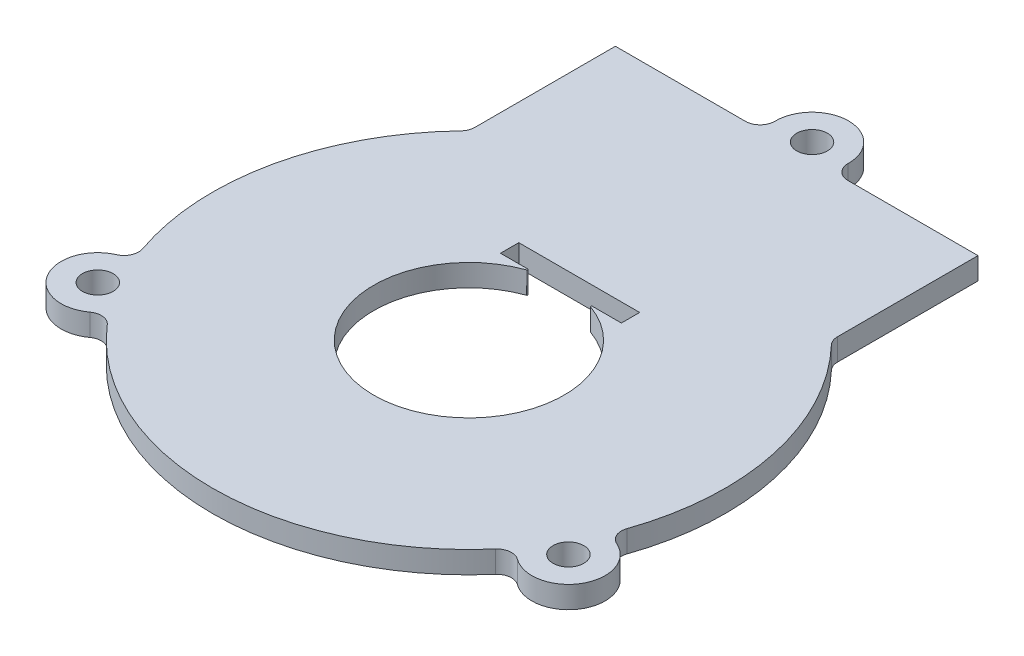
ISO-10303-21;
HEADER;
FILE_DESCRIPTION(('STEP AP214'),'2;1');
FILE_NAME('part.step','',(''),(''),'','','');
FILE_SCHEMA(('AUTOMOTIVE_DESIGN { 1 0 10303 214 1 1 1 1 }'));
ENDSEC;
DATA;
#1=APPLICATION_CONTEXT('core data for automotive mechanical design processes');
#2=APPLICATION_PROTOCOL_DEFINITION('international standard','automotive_design',2000,#1);
#3=PRODUCT_CONTEXT('',#1,'mechanical');
#4=PRODUCT('Part','Part','',(#3));
#5=PRODUCT_RELATED_PRODUCT_CATEGORY('part','',(#4));
#6=PRODUCT_DEFINITION_FORMATION('','',#4);
#7=PRODUCT_DEFINITION_CONTEXT('part definition',#1,'design');
#8=PRODUCT_DEFINITION('design','',#6,#7);
#9=PRODUCT_DEFINITION_SHAPE('','',#8);
#10=(LENGTH_UNIT() NAMED_UNIT(*) SI_UNIT(.MILLI.,.METRE.));
#11=(NAMED_UNIT(*) PLANE_ANGLE_UNIT() SI_UNIT($,.RADIAN.));
#12=(NAMED_UNIT(*) SI_UNIT($,.STERADIAN.) SOLID_ANGLE_UNIT());
#13=UNCERTAINTY_MEASURE_WITH_UNIT(LENGTH_MEASURE(1.E-05),#10,'distance_accuracy_value','');
#14=(GEOMETRIC_REPRESENTATION_CONTEXT(3) GLOBAL_UNCERTAINTY_ASSIGNED_CONTEXT((#13)) GLOBAL_UNIT_ASSIGNED_CONTEXT((#10,
#11,#12)) REPRESENTATION_CONTEXT('',''));
#15=CARTESIAN_POINT('',(0.,0.,0.));
#16=DIRECTION('',(0.,0.,1.));
#17=DIRECTION('',(1.,0.,0.));
#18=AXIS2_PLACEMENT_3D('',#15,#16,#17);
#19=CARTESIAN_POINT('',(0.,3.,0.));
#20=DIRECTION('',(0.,1.,0.));
#21=DIRECTION('',(0.,0.,1.));
#22=AXIS2_PLACEMENT_3D('',#19,#20,#21);
#23=PLANE('',#22);
#24=CARTESIAN_POINT('',(-32.1480166138315,3.,18.5087961651664));
#25=DIRECTION('',(0.,1.,0.));
#26=DIRECTION('',(0.,0.,1.));
#27=AXIS2_PLACEMENT_3D('',#24,#25,#26);
#28=CIRCLE('',#27,2.09999999999999);
#29=CARTESIAN_POINT('',(-32.1480166138315,3.,20.6087961651664));
#30=VERTEX_POINT('',#29);
#31=EDGE_CURVE('E260',#30,#30,#28,.T.);
#32=ORIENTED_EDGE('',*,*,#31,.F.);
#33=EDGE_LOOP('',(#32));
#34=FACE_BOUND('',#33,.T.);
#35=DIRECTION('',(-3.02063810260161E-06,0.,-0.999999999995438));
#36=VECTOR('',#35,1.);
#37=CARTESIAN_POINT('',(-24.7478001128037,3.,-24.7496745347634));
#38=LINE('',#37,#36);
#39=CARTESIAN_POINT('',(-24.7478025747881,3.,-25.5647289504072));
#40=VERTEX_POINT('',#39);
#41=CARTESIAN_POINT('',(-24.7478605121482,3.,-44.7452325826062));
#42=VERTEX_POINT('',#41);
#43=EDGE_CURVE('E308',#40,#42,#38,.T.);
#44=ORIENTED_EDGE('',*,*,#43,.F.);
#45=CARTESIAN_POINT('',(-26.747802574779,3.,-25.564722909131));
#46=DIRECTION('',(0.,1.,0.));
#47=DIRECTION('',(0.,0.,1.));
#48=AXIS2_PLACEMENT_3D('',#45,#46,#47);
#49=CIRCLE('',#48,2.);
#50=CARTESIAN_POINT('',(-25.3019754085747,3.,-24.1828459951239));
#51=VERTEX_POINT('',#50);
#52=EDGE_CURVE('E333',#40,#51,#49,.F.);
#53=ORIENTED_EDGE('',*,*,#52,.T.);
#54=CARTESIAN_POINT('',(0.,3.,0.));
#55=DIRECTION('',(0.,1.,0.));
#56=DIRECTION('',(0.,0.,1.));
#57=AXIS2_PLACEMENT_3D('',#54,#55,#56);
#58=CIRCLE('',#57,35.);
#59=CARTESIAN_POINT('',(-33.072840065109,3.,11.4537002766671));
#60=VERTEX_POINT('',#59);
#61=EDGE_CURVE('E319',#51,#60,#58,.T.);
#62=ORIENTED_EDGE('',*,*,#61,.T.);
#63=CARTESIAN_POINT('',(-34.9627166402581,3.,12.1081974353338));
#64=DIRECTION('',(0.,1.,0.));
#65=DIRECTION('',(0.,0.,1.));
#66=AXIS2_PLACEMENT_3D('',#63,#64,#65);
#67=CIRCLE('',#66,2.);
#68=CARTESIAN_POINT('',(-34.1580179965192,3.,13.9391698799011));
#69=VERTEX_POINT('',#68);
#70=EDGE_CURVE('E343',#60,#69,#67,.F.);
#71=ORIENTED_EDGE('',*,*,#70,.T.);
#72=CARTESIAN_POINT('',(-32.1464555555357,3.,18.5161819435163));
#73=DIRECTION('',(0.,1.,0.));
#74=DIRECTION('',(0.,0.,1.));
#75=AXIS2_PLACEMENT_3D('',#72,#73,#74);
#76=CIRCLE('',#75,4.99954226749351);
#77=CARTESIAN_POINT('',(-29.1966357044392,3.,22.5527628891349));
#78=VERTEX_POINT('',#77);
#79=EDGE_CURVE('E266',#69,#78,#76,.T.);
#80=ORIENTED_EDGE('',*,*,#79,.T.);
#81=CARTESIAN_POINT('',(-28.0165997358363,3.,24.1675430948605));
#82=DIRECTION('',(0.,1.,0.));
#83=DIRECTION('',(0.,0.,1.));
#84=AXIS2_PLACEMENT_3D('',#81,#82,#83);
#85=CIRCLE('',#84,2.);
#86=CARTESIAN_POINT('',(-26.5021889393046,3.,22.8611894140572));
#87=VERTEX_POINT('',#86);
#88=EDGE_CURVE('E354',#78,#87,#85,.F.);
#89=ORIENTED_EDGE('',*,*,#88,.T.);
#90=CARTESIAN_POINT('',(26.4887144081727,3.,22.8768006723464));
#91=VERTEX_POINT('',#90);
#92=EDGE_CURVE('E323',#87,#91,#58,.T.);
#93=ORIENTED_EDGE('',*,*,#92,.T.);
#94=CARTESIAN_POINT('',(28.0023552314968,3.,24.1840464250519));
#95=DIRECTION('',(0.,1.,0.));
#96=DIRECTION('',(0.,0.,1.));
#97=AXIS2_PLACEMENT_3D('',#94,#95,#96);
#98=CIRCLE('',#97,2.);
#99=CARTESIAN_POINT('',(29.184359284545,3.,22.5707062815676));
#100=VERTEX_POINT('',#99);
#101=EDGE_CURVE('E362',#91,#100,#98,.F.);
#102=ORIENTED_EDGE('',*,*,#101,.T.);
#103=CARTESIAN_POINT('',(32.1364886347761,3.,18.5412879583363));
#104=DIRECTION('',(0.,1.,0.));
#105=DIRECTION('',(0.,0.,1.));
#106=AXIS2_PLACEMENT_3D('',#103,#104,#105);
#107=CIRCLE('',#106,4.9951255964279);
#108=CARTESIAN_POINT('',(34.147287178261,3.,13.9687647007018));
#109=VERTEX_POINT('',#108);
#110=EDGE_CURVE('E277',#100,#109,#107,.T.);
#111=ORIENTED_EDGE('',*,*,#110,.T.);
#112=CARTESIAN_POINT('',(34.9523914763083,3.,12.1379705917791));
#113=DIRECTION('',(0.,1.,0.));
#114=DIRECTION('',(0.,0.,1.));
#115=AXIS2_PLACEMENT_3D('',#112,#113,#114);
#116=CIRCLE('',#115,2.);
#117=CARTESIAN_POINT('',(33.0630730181294,3.,11.4818640733046));
#118=VERTEX_POINT('',#117);
#119=EDGE_CURVE('E373',#109,#118,#116,.F.);
#120=ORIENTED_EDGE('',*,*,#119,.T.);
#121=CARTESIAN_POINT('',(25.3018293128609,3.,-24.1829988509046));
#122=VERTEX_POINT('',#121);
#123=EDGE_CURVE('E324',#118,#122,#58,.T.);
#124=ORIENTED_EDGE('',*,*,#123,.T.);
#125=CARTESIAN_POINT('',(26.7476481307387,3.,-25.5648844995277));
#126=DIRECTION('',(0.,1.,0.));
#127=DIRECTION('',(0.,0.,1.));
#128=AXIS2_PLACEMENT_3D('',#125,#126,#127);
#129=CIRCLE('',#128,2.);
#130=CARTESIAN_POINT('',(24.7476481307478,3.,-25.5648784582515));
#131=VERTEX_POINT('',#130);
#132=EDGE_CURVE('E380',#122,#131,#129,.F.);
#133=ORIENTED_EDGE('',*,*,#132,.T.);
#134=DIRECTION('',(-3.02063810260161E-06,0.,-0.999999999995438));
#135=VECTOR('',#134,1.);
#136=CARTESIAN_POINT('',(24.7476505927322,3.,-24.7498240426077));
#137=LINE('',#136,#135);
#138=CARTESIAN_POINT('',(24.7475901933877,3.,-44.7453820904505));
#139=VERTEX_POINT('',#138);
#140=EDGE_CURVE('E293',#131,#139,#137,.T.);
#141=ORIENTED_EDGE('',*,*,#140,.T.);
#142=DIRECTION('',(0.999999999995438,0.,-3.0206381024394E-06));
#143=VECTOR('',#142,1.);
#144=CARTESIAN_POINT('',(-24.7478605121482,3.,-44.7452325826062));
#145=LINE('',#144,#143);
#146=CARTESIAN_POINT('',(6.99533660471705,3.,-44.7453284673169));
#147=VERTEX_POINT('',#146);
#148=EDGE_CURVE('E304',#147,#139,#145,.T.);
#149=ORIENTED_EDGE('',*,*,#148,.F.);
#150=CARTESIAN_POINT('',(6.99533056344084,3.,-46.7453284673078));
#151=DIRECTION('',(0.,1.,0.));
#152=DIRECTION('',(0.,0.,1.));
#153=AXIS2_PLACEMENT_3D('',#150,#151,#152);
#154=CIRCLE('',#153,2.);
#155=CARTESIAN_POINT('',(4.99551899083441,3.,-46.7727815922561));
#156=VERTEX_POINT('',#155);
#157=EDGE_CURVE('E390',#147,#156,#154,.F.);
#158=ORIENTED_EDGE('',*,*,#157,.T.);
#159=CARTESIAN_POINT('',(0.,3.,-46.8413593567393));
#160=DIRECTION('',(0.,1.,0.));
#161=DIRECTION('',(0.,0.,1.));
#162=AXIS2_PLACEMENT_3D('',#159,#160,#161);
#163=CIRCLE('',#162,4.99598968149142);
#164=CARTESIAN_POINT('',(-4.99551857644603,3.,-46.7727514129473));
#165=VERTEX_POINT('',#164);
#166=EDGE_CURVE('E286',#156,#165,#163,.T.);
#167=ORIENTED_EDGE('',*,*,#166,.T.);
#168=CARTESIAN_POINT('',(-6.99532998316405,3.,-46.7452862065854));
#169=DIRECTION('',(0.,1.,0.));
#170=DIRECTION('',(0.,0.,1.));
#171=AXIS2_PLACEMENT_3D('',#168,#169,#170);
#172=CIRCLE('',#171,2.);
#173=CARTESIAN_POINT('',(-6.99532394188785,3.,-44.7452862065945));
#174=VERTEX_POINT('',#173);
#175=EDGE_CURVE('E401',#165,#174,#172,.F.);
#176=ORIENTED_EDGE('',*,*,#175,.T.);
#177=EDGE_CURVE('E305',#42,#174,#145,.T.);
#178=ORIENTED_EDGE('',*,*,#177,.F.);
#179=EDGE_LOOP('',(#44,#53,#62,#71,#80,#89,#93,#102,#111,#120,#124,#133,#141,#149,#158,#167,
#176,#178));
#180=FACE_BOUND('',#179,.T.);
#181=CARTESIAN_POINT('',(32.1247811991366,3.,18.5356173256723));
#182=DIRECTION('',(0.,1.,0.));
#183=DIRECTION('',(0.,0.,1.));
#184=AXIS2_PLACEMENT_3D('',#181,#182,#183);
#185=CIRCLE('',#184,2.1);
#186=CARTESIAN_POINT('',(32.1247811991366,3.,20.6356173256723));
#187=VERTEX_POINT('',#186);
#188=EDGE_CURVE('E271',#187,#187,#185,.T.);
#189=ORIENTED_EDGE('',*,*,#188,.F.);
#190=EDGE_LOOP('',(#189));
#191=FACE_BOUND('',#190,.T.);
#192=CARTESIAN_POINT('',(0.,3.,-46.8413593567393));
#193=DIRECTION('',(0.,1.,0.));
#194=DIRECTION('',(0.,0.,1.));
#195=AXIS2_PLACEMENT_3D('',#192,#193,#194);
#196=CIRCLE('',#195,2.09605202456873);
#197=CARTESIAN_POINT('',(0.,3.,-44.7453073321706));
#198=VERTEX_POINT('',#197);
#199=EDGE_CURVE('E282',#198,#198,#196,.T.);
#200=ORIENTED_EDGE('',*,*,#199,.F.);
#201=EDGE_LOOP('',(#200));
#202=FACE_BOUND('',#201,.T.);
#203=DIRECTION('',(-1.,0.,0.));
#204=VECTOR('',#203,1.);
#205=CARTESIAN_POINT('',(8.37780637247631,3.,-12.4336030901751));
#206=LINE('',#205,#204);
#207=CARTESIAN_POINT('',(8.37780637247631,3.,-12.4336030901751));
#208=VERTEX_POINT('',#207);
#209=CARTESIAN_POINT('',(4.41500111144088,3.,-12.4336030901751));
#210=VERTEX_POINT('',#209);
#211=EDGE_CURVE('E243',#208,#210,#206,.T.);
#212=ORIENTED_EDGE('',*,*,#211,.T.);
#213=CARTESIAN_POINT('',(4.41500111144088,3.,-12.3336030901751));
#214=DIRECTION('',(0.,1.,0.));
#215=DIRECTION('',(0.,0.,1.));
#216=AXIS2_PLACEMENT_3D('',#213,#214,#215);
#217=CIRCLE('',#216,0.1);
#218=CARTESIAN_POINT('',(4.38129881288027,3.,-12.2394534482653));
#219=VERTEX_POINT('',#218);
#220=EDGE_CURVE('E408',#210,#219,#217,.T.);
#221=ORIENTED_EDGE('',*,*,#220,.T.);
#222=CARTESIAN_POINT('',(0.,3.,0.));
#223=DIRECTION('',(0.,1.,0.));
#224=DIRECTION('',(0.,0.,1.));
#225=AXIS2_PLACEMENT_3D('',#222,#223,#224);
#226=CIRCLE('',#225,13.);
#227=CARTESIAN_POINT('',(-4.38129881288027,3.,-12.2394534482653));
#228=VERTEX_POINT('',#227);
#229=EDGE_CURVE('E254',#228,#219,#226,.T.);
#230=ORIENTED_EDGE('',*,*,#229,.F.);
#231=CARTESIAN_POINT('',(-4.41500111144089,3.,-12.3336030901751));
#232=DIRECTION('',(0.,1.,0.));
#233=DIRECTION('',(0.,0.,1.));
#234=AXIS2_PLACEMENT_3D('',#231,#232,#233);
#235=CIRCLE('',#234,0.1);
#236=CARTESIAN_POINT('',(-4.41500111144089,3.,-12.4336030901751));
#237=VERTEX_POINT('',#236);
#238=EDGE_CURVE('E406',#228,#237,#235,.T.);
#239=ORIENTED_EDGE('',*,*,#238,.T.);
#240=CARTESIAN_POINT('',(-8.12219362752369,3.,-12.4336030901751));
#241=VERTEX_POINT('',#240);
#242=EDGE_CURVE('E240',#237,#241,#206,.T.);
#243=ORIENTED_EDGE('',*,*,#242,.T.);
#244=DIRECTION('',(0.,0.,-1.));
#245=VECTOR('',#244,1.);
#246=CARTESIAN_POINT('',(-8.12219362752369,3.,-12.4336030901751));
#247=LINE('',#246,#245);
#248=CARTESIAN_POINT('',(-8.12219362752369,3.,-14.9336030901751));
#249=VERTEX_POINT('',#248);
#250=EDGE_CURVE('E221',#241,#249,#247,.T.);
#251=ORIENTED_EDGE('',*,*,#250,.T.);
#252=DIRECTION('',(-1.,0.,0.));
#253=VECTOR('',#252,1.);
#254=CARTESIAN_POINT('',(8.37780637247631,3.,-14.9336030901751));
#255=LINE('',#254,#253);
#256=CARTESIAN_POINT('',(8.37780637247631,3.,-14.9336030901751));
#257=VERTEX_POINT('',#256);
#258=EDGE_CURVE('E230',#257,#249,#255,.T.);
#259=ORIENTED_EDGE('',*,*,#258,.F.);
#260=DIRECTION('',(0.,0.,-1.));
#261=VECTOR('',#260,1.);
#262=CARTESIAN_POINT('',(8.37780637247631,3.,-12.4336030901751));
#263=LINE('',#262,#261);
#264=EDGE_CURVE('E227',#208,#257,#263,.T.);
#265=ORIENTED_EDGE('',*,*,#264,.F.);
#266=EDGE_LOOP('',(#212,#221,#230,#239,#243,#251,#259,#265));
#267=FACE_BOUND('',#266,.T.);
#268=ADVANCED_FACE('F43',(#34,#180,#191,#202,#267),#23,.T.);
#269=CARTESIAN_POINT('',(0.,0.,0.));
#270=DIRECTION('',(0.,1.,0.));
#271=DIRECTION('',(0.,0.,1.));
#272=AXIS2_PLACEMENT_3D('',#269,#270,#271);
#273=PLANE('',#272);
#274=CARTESIAN_POINT('',(0.,0.,0.));
#275=DIRECTION('',(0.,1.,0.));
#276=DIRECTION('',(0.,0.,1.));
#277=AXIS2_PLACEMENT_3D('',#274,#275,#276);
#278=CIRCLE('',#277,35.);
#279=CARTESIAN_POINT('',(-26.5021889393046,0.,22.8611894140572));
#280=VERTEX_POINT('',#279);
#281=CARTESIAN_POINT('',(26.4887144081727,0.,22.8768006723464));
#282=VERTEX_POINT('',#281);
#283=EDGE_CURVE('E328',#280,#282,#278,.T.);
#284=ORIENTED_EDGE('',*,*,#283,.F.);
#285=CARTESIAN_POINT('',(-28.0165997358363,0.,24.1675430948605));
#286=DIRECTION('',(0.,1.,0.));
#287=DIRECTION('',(0.,0.,1.));
#288=AXIS2_PLACEMENT_3D('',#285,#286,#287);
#289=CIRCLE('',#288,2.);
#290=CARTESIAN_POINT('',(-29.1966357044392,0.,22.5527628891349));
#291=VERTEX_POINT('',#290);
#292=EDGE_CURVE('E352',#280,#291,#289,.T.);
#293=ORIENTED_EDGE('',*,*,#292,.T.);
#294=CARTESIAN_POINT('',(-32.1464555555357,0.,18.5161819435163));
#295=DIRECTION('',(0.,1.,0.));
#296=DIRECTION('',(0.,0.,1.));
#297=AXIS2_PLACEMENT_3D('',#294,#295,#296);
#298=CIRCLE('',#297,4.99954226749351);
#299=CARTESIAN_POINT('',(-34.1580179965192,0.,13.9391698799011));
#300=VERTEX_POINT('',#299);
#301=EDGE_CURVE('E269',#291,#300,#298,.F.);
#302=ORIENTED_EDGE('',*,*,#301,.T.);
#303=CARTESIAN_POINT('',(-34.9627166402581,0.,12.1081974353338));
#304=DIRECTION('',(0.,1.,0.));
#305=DIRECTION('',(0.,0.,1.));
#306=AXIS2_PLACEMENT_3D('',#303,#304,#305);
#307=CIRCLE('',#306,2.);
#308=CARTESIAN_POINT('',(-33.072840065109,0.,11.4537002766671));
#309=VERTEX_POINT('',#308);
#310=EDGE_CURVE('E345',#300,#309,#307,.T.);
#311=ORIENTED_EDGE('',*,*,#310,.T.);
#312=CARTESIAN_POINT('',(-25.3019754085747,0.,-24.1828459951239));
#313=VERTEX_POINT('',#312);
#314=EDGE_CURVE('E325',#313,#309,#278,.T.);
#315=ORIENTED_EDGE('',*,*,#314,.F.);
#316=CARTESIAN_POINT('',(-26.747802574779,0.,-25.564722909131));
#317=DIRECTION('',(0.,1.,0.));
#318=DIRECTION('',(0.,0.,1.));
#319=AXIS2_PLACEMENT_3D('',#316,#317,#318);
#320=CIRCLE('',#319,2.);
#321=CARTESIAN_POINT('',(-24.7478025747881,0.,-25.5647289504072));
#322=VERTEX_POINT('',#321);
#323=EDGE_CURVE('E335',#313,#322,#320,.T.);
#324=ORIENTED_EDGE('',*,*,#323,.T.);
#325=DIRECTION('',(3.02063810260161E-06,0.,0.999999999995438));
#326=VECTOR('',#325,1.);
#327=CARTESIAN_POINT('',(-24.7478001128037,0.,-24.7496745347634));
#328=LINE('',#327,#326);
#329=CARTESIAN_POINT('',(-24.7478605121482,0.,-44.7452325826062));
#330=VERTEX_POINT('',#329);
#331=EDGE_CURVE('E294',#330,#322,#328,.T.);
#332=ORIENTED_EDGE('',*,*,#331,.F.);
#333=DIRECTION('',(-0.999999999995438,0.,3.0206381024394E-06));
#334=VECTOR('',#333,1.);
#335=CARTESIAN_POINT('',(-24.7478605121482,0.,-44.7452325826062));
#336=LINE('',#335,#334);
#337=CARTESIAN_POINT('',(-6.99532394188785,0.,-44.7452862065945));
#338=VERTEX_POINT('',#337);
#339=EDGE_CURVE('E314',#338,#330,#336,.T.);
#340=ORIENTED_EDGE('',*,*,#339,.F.);
#341=CARTESIAN_POINT('',(-6.99532998316405,0.,-46.7452862065854));
#342=DIRECTION('',(0.,1.,0.));
#343=DIRECTION('',(0.,0.,1.));
#344=AXIS2_PLACEMENT_3D('',#341,#342,#343);
#345=CIRCLE('',#344,2.);
#346=CARTESIAN_POINT('',(-4.99551857644603,0.,-46.7727514129473));
#347=VERTEX_POINT('',#346);
#348=EDGE_CURVE('E399',#338,#347,#345,.T.);
#349=ORIENTED_EDGE('',*,*,#348,.T.);
#350=CARTESIAN_POINT('',(0.,0.,-46.8413593567393));
#351=DIRECTION('',(0.,1.,0.));
#352=DIRECTION('',(0.,0.,1.));
#353=AXIS2_PLACEMENT_3D('',#350,#351,#352);
#354=CIRCLE('',#353,4.99598968149142);
#355=CARTESIAN_POINT('',(4.99551899083441,0.,-46.7727815922561));
#356=VERTEX_POINT('',#355);
#357=EDGE_CURVE('E283',#347,#356,#354,.F.);
#358=ORIENTED_EDGE('',*,*,#357,.T.);
#359=CARTESIAN_POINT('',(6.99533056344084,0.,-46.7453284673078));
#360=DIRECTION('',(0.,1.,0.));
#361=DIRECTION('',(0.,0.,1.));
#362=AXIS2_PLACEMENT_3D('',#359,#360,#361);
#363=CIRCLE('',#362,2.);
#364=CARTESIAN_POINT('',(6.99533660471705,0.,-44.7453284673169));
#365=VERTEX_POINT('',#364);
#366=EDGE_CURVE('E392',#356,#365,#363,.T.);
#367=ORIENTED_EDGE('',*,*,#366,.T.);
#368=CARTESIAN_POINT('',(24.7475901933877,0.,-44.7453820904505));
#369=VERTEX_POINT('',#368);
#370=EDGE_CURVE('E298',#369,#365,#336,.T.);
#371=ORIENTED_EDGE('',*,*,#370,.F.);
#372=DIRECTION('',(3.02063810260161E-06,0.,0.999999999995438));
#373=VECTOR('',#372,1.);
#374=CARTESIAN_POINT('',(24.7476505927322,0.,-24.7498240426077));
#375=LINE('',#374,#373);
#376=CARTESIAN_POINT('',(24.7476481307478,0.,-25.5648784582515));
#377=VERTEX_POINT('',#376);
#378=EDGE_CURVE('E297',#369,#377,#375,.T.);
#379=ORIENTED_EDGE('',*,*,#378,.T.);
#380=CARTESIAN_POINT('',(26.7476481307387,0.,-25.5648844995277));
#381=DIRECTION('',(0.,1.,0.));
#382=DIRECTION('',(0.,0.,1.));
#383=AXIS2_PLACEMENT_3D('',#380,#381,#382);
#384=CIRCLE('',#383,2.);
#385=CARTESIAN_POINT('',(25.3018293128609,0.,-24.1829988509046));
#386=VERTEX_POINT('',#385);
#387=EDGE_CURVE('E382',#377,#386,#384,.T.);
#388=ORIENTED_EDGE('',*,*,#387,.T.);
#389=CARTESIAN_POINT('',(33.0630730181294,0.,11.4818640733046));
#390=VERTEX_POINT('',#389);
#391=EDGE_CURVE('E301',#390,#386,#278,.T.);
#392=ORIENTED_EDGE('',*,*,#391,.F.);
#393=CARTESIAN_POINT('',(34.9523914763083,0.,12.1379705917791));
#394=DIRECTION('',(0.,1.,0.));
#395=DIRECTION('',(0.,0.,1.));
#396=AXIS2_PLACEMENT_3D('',#393,#394,#395);
#397=CIRCLE('',#396,2.);
#398=CARTESIAN_POINT('',(34.147287178261,0.,13.9687647007018));
#399=VERTEX_POINT('',#398);
#400=EDGE_CURVE('E371',#390,#399,#397,.T.);
#401=ORIENTED_EDGE('',*,*,#400,.T.);
#402=CARTESIAN_POINT('',(32.1364886347761,0.,18.5412879583363));
#403=DIRECTION('',(0.,1.,0.));
#404=DIRECTION('',(0.,0.,1.));
#405=AXIS2_PLACEMENT_3D('',#402,#403,#404);
#406=CIRCLE('',#405,4.9951255964279);
#407=CARTESIAN_POINT('',(29.184359284545,0.,22.5707062815676));
#408=VERTEX_POINT('',#407);
#409=EDGE_CURVE('E280',#399,#408,#406,.F.);
#410=ORIENTED_EDGE('',*,*,#409,.T.);
#411=CARTESIAN_POINT('',(28.0023552314968,0.,24.1840464250519));
#412=DIRECTION('',(0.,1.,0.));
#413=DIRECTION('',(0.,0.,1.));
#414=AXIS2_PLACEMENT_3D('',#411,#412,#413);
#415=CIRCLE('',#414,2.);
#416=EDGE_CURVE('E364',#408,#282,#415,.T.);
#417=ORIENTED_EDGE('',*,*,#416,.T.);
#418=EDGE_LOOP('',(#284,#293,#302,#311,#315,#324,#332,#340,#349,#358,#367,#371,#379,#388,#392,
#401,#410,#417));
#419=FACE_BOUND('',#418,.T.);
#420=CARTESIAN_POINT('',(0.,0.,-46.8413593567393));
#421=DIRECTION('',(0.,1.,0.));
#422=DIRECTION('',(0.,0.,1.));
#423=AXIS2_PLACEMENT_3D('',#420,#421,#422);
#424=CIRCLE('',#423,2.09605202456873);
#425=CARTESIAN_POINT('',(0.,0.,-44.7453073321706));
#426=VERTEX_POINT('',#425);
#427=EDGE_CURVE('E285',#426,#426,#424,.F.);
#428=ORIENTED_EDGE('',*,*,#427,.F.);
#429=EDGE_LOOP('',(#428));
#430=FACE_BOUND('',#429,.T.);
#431=CARTESIAN_POINT('',(32.1247811991366,0.,18.5356173256723));
#432=DIRECTION('',(0.,1.,0.));
#433=DIRECTION('',(0.,0.,1.));
#434=AXIS2_PLACEMENT_3D('',#431,#432,#433);
#435=CIRCLE('',#434,2.1);
#436=CARTESIAN_POINT('',(32.1247811991366,0.,20.6356173256723));
#437=VERTEX_POINT('',#436);
#438=EDGE_CURVE('E274',#437,#437,#435,.T.);
#439=ORIENTED_EDGE('',*,*,#438,.T.);
#440=EDGE_LOOP('',(#439));
#441=FACE_BOUND('',#440,.T.);
#442=CARTESIAN_POINT('',(-32.1480166138315,0.,18.5087961651664));
#443=DIRECTION('',(0.,1.,0.));
#444=DIRECTION('',(0.,0.,1.));
#445=AXIS2_PLACEMENT_3D('',#442,#443,#444);
#446=CIRCLE('',#445,2.1);
#447=CARTESIAN_POINT('',(-32.1480166138315,0.,20.6087961651664));
#448=VERTEX_POINT('',#447);
#449=EDGE_CURVE('E263',#448,#448,#446,.T.);
#450=ORIENTED_EDGE('',*,*,#449,.T.);
#451=EDGE_LOOP('',(#450));
#452=FACE_BOUND('',#451,.T.);
#453=CARTESIAN_POINT('',(0.,0.,0.));
#454=DIRECTION('',(0.,1.,0.));
#455=DIRECTION('',(0.,0.,1.));
#456=AXIS2_PLACEMENT_3D('',#453,#454,#455);
#457=CIRCLE('',#456,13.);
#458=CARTESIAN_POINT('',(4.38129881288027,0.,-12.2394534482653));
#459=VERTEX_POINT('',#458);
#460=CARTESIAN_POINT('',(-4.38129881288027,0.,-12.2394534482653));
#461=VERTEX_POINT('',#460);
#462=EDGE_CURVE('E257',#459,#461,#457,.F.);
#463=ORIENTED_EDGE('',*,*,#462,.F.);
#464=CARTESIAN_POINT('',(4.41500111144088,0.,-12.3336030901751));
#465=DIRECTION('',(0.,1.,0.));
#466=DIRECTION('',(0.,0.,1.));
#467=AXIS2_PLACEMENT_3D('',#464,#465,#466);
#468=CIRCLE('',#467,0.1);
#469=CARTESIAN_POINT('',(4.41500111144088,0.,-12.4336030901751));
#470=VERTEX_POINT('',#469);
#471=EDGE_CURVE('E51',#459,#470,#468,.F.);
#472=ORIENTED_EDGE('',*,*,#471,.T.);
#473=DIRECTION('',(1.,0.,0.));
#474=VECTOR('',#473,1.);
#475=CARTESIAN_POINT('',(8.37780637247631,0.,-12.4336030901751));
#476=LINE('',#475,#474);
#477=CARTESIAN_POINT('',(8.37780637247631,0.,-12.4336030901751));
#478=VERTEX_POINT('',#477);
#479=EDGE_CURVE('E253',#470,#478,#476,.T.);
#480=ORIENTED_EDGE('',*,*,#479,.T.);
#481=DIRECTION('',(0.,0.,1.));
#482=VECTOR('',#481,1.);
#483=CARTESIAN_POINT('',(8.37780637247631,0.,-12.4336030901751));
#484=LINE('',#483,#482);
#485=CARTESIAN_POINT('',(8.37780637247631,0.,-14.9336030901751));
#486=VERTEX_POINT('',#485);
#487=EDGE_CURVE('E435',#486,#478,#484,.T.);
#488=ORIENTED_EDGE('',*,*,#487,.F.);
#489=DIRECTION('',(1.,0.,0.));
#490=VECTOR('',#489,1.);
#491=CARTESIAN_POINT('',(8.37780637247631,0.,-14.9336030901751));
#492=LINE('',#491,#490);
#493=CARTESIAN_POINT('',(-8.12219362752369,0.,-14.9336030901751));
#494=VERTEX_POINT('',#493);
#495=EDGE_CURVE('E258',#494,#486,#492,.T.);
#496=ORIENTED_EDGE('',*,*,#495,.F.);
#497=DIRECTION('',(0.,0.,1.));
#498=VECTOR('',#497,1.);
#499=CARTESIAN_POINT('',(-8.12219362752369,0.,-12.4336030901751));
#500=LINE('',#499,#498);
#501=CARTESIAN_POINT('',(-8.12219362752369,0.,-12.4336030901751));
#502=VERTEX_POINT('',#501);
#503=EDGE_CURVE('E223',#494,#502,#500,.T.);
#504=ORIENTED_EDGE('',*,*,#503,.T.);
#505=CARTESIAN_POINT('',(-4.41500111144089,0.,-12.4336030901751));
#506=VERTEX_POINT('',#505);
#507=EDGE_CURVE('E426',#502,#506,#476,.T.);
#508=ORIENTED_EDGE('',*,*,#507,.T.);
#509=CARTESIAN_POINT('',(-4.41500111144089,0.,-12.3336030901751));
#510=DIRECTION('',(0.,1.,0.));
#511=DIRECTION('',(0.,0.,1.));
#512=AXIS2_PLACEMENT_3D('',#509,#510,#511);
#513=CIRCLE('',#512,0.1);
#514=EDGE_CURVE('E58',#506,#461,#513,.F.);
#515=ORIENTED_EDGE('',*,*,#514,.T.);
#516=EDGE_LOOP('',(#463,#472,#480,#488,#496,#504,#508,#515));
#517=FACE_BOUND('',#516,.T.);
#518=ADVANCED_FACE('F416',(#419,#430,#441,#452,#517),#273,.F.);
#519=CARTESIAN_POINT('',(0.,-36.7695526217005,0.));
#520=DIRECTION('',(0.,1.,0.));
#521=DIRECTION('',(0.,0.,1.));
#522=AXIS2_PLACEMENT_3D('',#519,#520,#521);
#523=CYLINDRICAL_SURFACE('',#522,13.);
#524=ORIENTED_EDGE('',*,*,#229,.T.);
#525=DIRECTION('',(0.,1.,0.));
#526=VECTOR('',#525,1.);
#527=CARTESIAN_POINT('',(4.38129881288027,-36.7695526217005,-12.2394534482653));
#528=LINE('',#527,#526);
#529=EDGE_CURVE('E412',#219,#459,#528,.F.);
#530=ORIENTED_EDGE('',*,*,#529,.T.);
#531=ORIENTED_EDGE('',*,*,#462,.T.);
#532=DIRECTION('',(0.,1.,0.));
#533=VECTOR('',#532,1.);
#534=CARTESIAN_POINT('',(-4.38129881288027,-36.7695526217005,-12.2394534482653));
#535=LINE('',#534,#533);
#536=EDGE_CURVE('E410',#461,#228,#535,.T.);
#537=ORIENTED_EDGE('',*,*,#536,.T.);
#538=EDGE_LOOP('',(#524,#530,#531,#537));
#539=FACE_BOUND('',#538,.T.);
#540=ADVANCED_FACE('F432',(#539),#523,.F.);
#541=CARTESIAN_POINT('',(0.,3.,0.));
#542=DIRECTION('',(0.,-1.,0.));
#543=DIRECTION('',(0.,0.,-1.));
#544=AXIS2_PLACEMENT_3D('',#541,#542,#543);
#545=CYLINDRICAL_SURFACE('',#544,35.);
#546=ORIENTED_EDGE('',*,*,#314,.T.);
#547=DIRECTION('',(0.,-1.,0.));
#548=VECTOR('',#547,1.);
#549=CARTESIAN_POINT('',(-33.072840065109,3.,11.4537002766671));
#550=LINE('',#549,#548);
#551=EDGE_CURVE('E337',#309,#60,#550,.F.);
#552=ORIENTED_EDGE('',*,*,#551,.T.);
#553=ORIENTED_EDGE('',*,*,#61,.F.);
#554=DIRECTION('',(0.,-1.,0.));
#555=VECTOR('',#554,1.);
#556=CARTESIAN_POINT('',(-25.3019754085747,3.,-24.1828459951239));
#557=LINE('',#556,#555);
#558=EDGE_CURVE('E331',#51,#313,#557,.T.);
#559=ORIENTED_EDGE('',*,*,#558,.T.);
#560=EDGE_LOOP('',(#546,#552,#553,#559));
#561=FACE_BOUND('',#560,.T.);
#562=ADVANCED_FACE('F468',(#561),#545,.T.);
#563=ORIENTED_EDGE('',*,*,#283,.T.);
#564=DIRECTION('',(0.,-1.,0.));
#565=VECTOR('',#564,1.);
#566=CARTESIAN_POINT('',(26.4887144081727,3.,22.8768006723464));
#567=LINE('',#566,#565);
#568=EDGE_CURVE('E356',#282,#91,#567,.F.);
#569=ORIENTED_EDGE('',*,*,#568,.T.);
#570=ORIENTED_EDGE('',*,*,#92,.F.);
#571=DIRECTION('',(0.,-1.,0.));
#572=VECTOR('',#571,1.);
#573=CARTESIAN_POINT('',(-26.5021889393046,3.,22.8611894140572));
#574=LINE('',#573,#572);
#575=EDGE_CURVE('E347',#87,#280,#574,.T.);
#576=ORIENTED_EDGE('',*,*,#575,.T.);
#577=EDGE_LOOP('',(#563,#569,#570,#576));
#578=FACE_BOUND('',#577,.T.);
#579=ADVANCED_FACE('F469',(#578),#545,.T.);
#580=CARTESIAN_POINT('',(-24.7478605121482,-53.381962685779,-44.7452325826062));
#581=DIRECTION('',(3.0206381024394E-06,0.,0.999999999995438));
#582=DIRECTION('',(0.999999999995438,0.,-3.0206381024394E-06));
#583=AXIS2_PLACEMENT_3D('',#580,#581,#582);
#584=PLANE('',#583);
#585=ORIENTED_EDGE('',*,*,#177,.T.);
#586=DIRECTION('',(0.,1.,0.));
#587=VECTOR('',#586,1.);
#588=CARTESIAN_POINT('',(-6.99532394188785,-53.381962685779,-44.7452862065945));
#589=LINE('',#588,#587);
#590=EDGE_CURVE('E394',#174,#338,#589,.F.);
#591=ORIENTED_EDGE('',*,*,#590,.T.);
#592=ORIENTED_EDGE('',*,*,#339,.T.);
#593=DIRECTION('',(0.,1.,0.));
#594=VECTOR('',#593,1.);
#595=CARTESIAN_POINT('',(-24.7478605121482,-53.381962685779,-44.7452325826062));
#596=LINE('',#595,#594);
#597=EDGE_CURVE('E311',#330,#42,#596,.T.);
#598=ORIENTED_EDGE('',*,*,#597,.T.);
#599=EDGE_LOOP('',(#585,#591,#592,#598));
#600=FACE_BOUND('',#599,.T.);
#601=ADVANCED_FACE('F466',(#600),#584,.F.);
#602=ORIENTED_EDGE('',*,*,#391,.T.);
#603=DIRECTION('',(0.,-1.,0.));
#604=VECTOR('',#603,1.);
#605=CARTESIAN_POINT('',(25.3018293128609,3.,-24.1829988509046));
#606=LINE('',#605,#604);
#607=EDGE_CURVE('E375',#386,#122,#606,.F.);
#608=ORIENTED_EDGE('',*,*,#607,.T.);
#609=ORIENTED_EDGE('',*,*,#123,.F.);
#610=DIRECTION('',(0.,-1.,0.));
#611=VECTOR('',#610,1.);
#612=CARTESIAN_POINT('',(33.0630730181294,3.,11.4818640733046));
#613=LINE('',#612,#611);
#614=EDGE_CURVE('E366',#118,#390,#613,.T.);
#615=ORIENTED_EDGE('',*,*,#614,.T.);
#616=EDGE_LOOP('',(#602,#608,#609,#615));
#617=FACE_BOUND('',#616,.T.);
#618=ADVANCED_FACE('F462',(#617),#545,.T.);
#619=ORIENTED_EDGE('',*,*,#370,.T.);
#620=DIRECTION('',(0.,1.,0.));
#621=VECTOR('',#620,1.);
#622=CARTESIAN_POINT('',(6.99533660471705,-53.381962685779,-44.7453284673169));
#623=LINE('',#622,#621);
#624=EDGE_CURVE('E384',#365,#147,#623,.T.);
#625=ORIENTED_EDGE('',*,*,#624,.T.);
#626=ORIENTED_EDGE('',*,*,#148,.T.);
#627=DIRECTION('',(0.,1.,0.));
#628=VECTOR('',#627,1.);
#629=CARTESIAN_POINT('',(24.7475901933877,-53.381962685779,-44.7453820904505));
#630=LINE('',#629,#628);
#631=EDGE_CURVE('E310',#369,#139,#630,.T.);
#632=ORIENTED_EDGE('',*,*,#631,.F.);
#633=EDGE_LOOP('',(#619,#625,#626,#632));
#634=FACE_BOUND('',#633,.T.);
#635=ADVANCED_FACE('F465',(#634),#584,.F.);
#636=CARTESIAN_POINT('',(-24.7478001128037,-53.381962685779,-24.7496745347634));
#637=DIRECTION('',(0.999999999995438,0.,-3.02063810260161E-06));
#638=DIRECTION('',(-3.02063810260161E-06,0.,-0.999999999995438));
#639=AXIS2_PLACEMENT_3D('',#636,#637,#638);
#640=PLANE('',#639);
#641=ORIENTED_EDGE('',*,*,#331,.T.);
#642=DIRECTION('',(0.,1.,0.));
#643=VECTOR('',#642,1.);
#644=CARTESIAN_POINT('',(-24.7478025747881,3.,-25.5647289504072));
#645=LINE('',#644,#643);
#646=EDGE_CURVE('E322',#322,#40,#645,.T.);
#647=ORIENTED_EDGE('',*,*,#646,.T.);
#648=ORIENTED_EDGE('',*,*,#43,.T.);
#649=ORIENTED_EDGE('',*,*,#597,.F.);
#650=EDGE_LOOP('',(#641,#647,#648,#649));
#651=FACE_BOUND('',#650,.T.);
#652=ADVANCED_FACE('F611',(#651),#640,.F.);
#653=CARTESIAN_POINT('',(24.7476505927322,-53.381962685779,-24.7498240426077));
#654=DIRECTION('',(0.999999999995438,0.,-3.02063810260161E-06));
#655=DIRECTION('',(-3.02063810260161E-06,0.,-0.999999999995438));
#656=AXIS2_PLACEMENT_3D('',#653,#654,#655);
#657=PLANE('',#656);
#658=ORIENTED_EDGE('',*,*,#140,.F.);
#659=DIRECTION('',(0.,-1.,0.));
#660=VECTOR('',#659,1.);
#661=CARTESIAN_POINT('',(24.7476481307478,-53.381962685779,-25.5648784582515));
#662=LINE('',#661,#660);
#663=EDGE_CURVE('E378',#131,#377,#662,.T.);
#664=ORIENTED_EDGE('',*,*,#663,.T.);
#665=ORIENTED_EDGE('',*,*,#378,.F.);
#666=ORIENTED_EDGE('',*,*,#631,.T.);
#667=EDGE_LOOP('',(#658,#664,#665,#666));
#668=FACE_BOUND('',#667,.T.);
#669=ADVANCED_FACE('F459',(#668),#657,.T.);
#670=CARTESIAN_POINT('',(0.,-14.1307927300824,-46.8413593567393));
#671=DIRECTION('',(0.,1.,0.));
#672=DIRECTION('',(0.,0.,1.));
#673=AXIS2_PLACEMENT_3D('',#670,#671,#672);
#674=CYLINDRICAL_SURFACE('',#673,4.99598968149142);
#675=ORIENTED_EDGE('',*,*,#357,.F.);
#676=DIRECTION('',(0.,1.,0.));
#677=VECTOR('',#676,1.);
#678=CARTESIAN_POINT('',(-4.99551857644604,-14.1307927300824,-46.7727514129473));
#679=LINE('',#678,#677);
#680=EDGE_CURVE('E397',#347,#165,#679,.T.);
#681=ORIENTED_EDGE('',*,*,#680,.T.);
#682=ORIENTED_EDGE('',*,*,#166,.F.);
#683=DIRECTION('',(0.,1.,0.));
#684=VECTOR('',#683,1.);
#685=CARTESIAN_POINT('',(4.99551899083441,-14.1307927300824,-46.7727815922561));
#686=LINE('',#685,#684);
#687=EDGE_CURVE('E387',#156,#356,#686,.F.);
#688=ORIENTED_EDGE('',*,*,#687,.T.);
#689=EDGE_LOOP('',(#675,#681,#682,#688));
#690=FACE_BOUND('',#689,.T.);
#691=ADVANCED_FACE('F577',(#690),#674,.T.);
#692=CARTESIAN_POINT('',(0.,-14.1307927300824,-46.8413593567393));
#693=DIRECTION('',(0.,1.,0.));
#694=DIRECTION('',(0.,0.,1.));
#695=AXIS2_PLACEMENT_3D('',#692,#693,#694);
#696=CYLINDRICAL_SURFACE('',#695,2.09605202456873);
#697=ORIENTED_EDGE('',*,*,#199,.T.);
#698=EDGE_LOOP('',(#697));
#699=FACE_BOUND('',#698,.T.);
#700=ORIENTED_EDGE('',*,*,#427,.T.);
#701=EDGE_LOOP('',(#700));
#702=FACE_BOUND('',#701,.T.);
#703=ADVANCED_FACE('F582',(#699,#702),#696,.F.);
#704=CARTESIAN_POINT('',(32.1364886347761,-14.1283487284507,18.5412879583363));
#705=DIRECTION('',(0.,1.,0.));
#706=DIRECTION('',(0.,0.,1.));
#707=AXIS2_PLACEMENT_3D('',#704,#705,#706);
#708=CYLINDRICAL_SURFACE('',#707,4.9951255964279);
#709=ORIENTED_EDGE('',*,*,#409,.F.);
#710=DIRECTION('',(0.,1.,0.));
#711=VECTOR('',#710,1.);
#712=CARTESIAN_POINT('',(34.147287178261,-14.1283487284507,13.9687647007018));
#713=LINE('',#712,#711);
#714=EDGE_CURVE('E369',#399,#109,#713,.T.);
#715=ORIENTED_EDGE('',*,*,#714,.T.);
#716=ORIENTED_EDGE('',*,*,#110,.F.);
#717=DIRECTION('',(0.,1.,0.));
#718=VECTOR('',#717,1.);
#719=CARTESIAN_POINT('',(29.184359284545,-14.1283487284507,22.5707062815676));
#720=LINE('',#719,#718);
#721=EDGE_CURVE('E359',#100,#408,#720,.F.);
#722=ORIENTED_EDGE('',*,*,#721,.T.);
#723=EDGE_LOOP('',(#709,#715,#716,#722));
#724=FACE_BOUND('',#723,.T.);
#725=ADVANCED_FACE('F642',(#724),#708,.T.);
#726=CARTESIAN_POINT('',(32.1247811991366,3.,18.5356173256723));
#727=DIRECTION('',(0.,1.,0.));
#728=DIRECTION('',(0.,0.,1.));
#729=AXIS2_PLACEMENT_3D('',#726,#727,#728);
#730=CYLINDRICAL_SURFACE('',#729,2.1);
#731=ORIENTED_EDGE('',*,*,#438,.F.);
#732=EDGE_LOOP('',(#731));
#733=FACE_BOUND('',#732,.T.);
#734=ORIENTED_EDGE('',*,*,#188,.T.);
#735=EDGE_LOOP('',(#734));
#736=FACE_BOUND('',#735,.T.);
#737=ADVANCED_FACE('F647',(#733,#736),#730,.F.);
#738=CARTESIAN_POINT('',(-32.1464555555357,-14.1408409606937,18.5161819435163));
#739=DIRECTION('',(0.,1.,0.));
#740=DIRECTION('',(0.,0.,1.));
#741=AXIS2_PLACEMENT_3D('',#738,#739,#740);
#742=CYLINDRICAL_SURFACE('',#741,4.99954226749351);
#743=ORIENTED_EDGE('',*,*,#301,.F.);
#744=DIRECTION('',(0.,1.,0.));
#745=VECTOR('',#744,1.);
#746=CARTESIAN_POINT('',(-29.1966357044392,-14.1408409606937,22.5527628891349));
#747=LINE('',#746,#745);
#748=EDGE_CURVE('E350',#291,#78,#747,.T.);
#749=ORIENTED_EDGE('',*,*,#748,.T.);
#750=ORIENTED_EDGE('',*,*,#79,.F.);
#751=DIRECTION('',(0.,1.,0.));
#752=VECTOR('',#751,1.);
#753=CARTESIAN_POINT('',(-34.1580179965192,-14.1408409606937,13.9391698799011));
#754=LINE('',#753,#752);
#755=EDGE_CURVE('E340',#69,#300,#754,.F.);
#756=ORIENTED_EDGE('',*,*,#755,.T.);
#757=EDGE_LOOP('',(#743,#749,#750,#756));
#758=FACE_BOUND('',#757,.T.);
#759=ADVANCED_FACE('F674',(#758),#742,.T.);
#760=CARTESIAN_POINT('',(-32.1480166138315,3.,18.5087961651664));
#761=DIRECTION('',(0.,1.,0.));
#762=DIRECTION('',(0.,0.,1.));
#763=AXIS2_PLACEMENT_3D('',#760,#761,#762);
#764=CYLINDRICAL_SURFACE('',#763,2.09999999999999);
#765=ORIENTED_EDGE('',*,*,#449,.F.);
#766=EDGE_LOOP('',(#765));
#767=FACE_BOUND('',#766,.T.);
#768=ORIENTED_EDGE('',*,*,#31,.T.);
#769=EDGE_LOOP('',(#768));
#770=FACE_BOUND('',#769,.T.);
#771=ADVANCED_FACE('F474',(#767,#770),#764,.F.);
#772=CARTESIAN_POINT('',(-26.747802574779,3.,-25.564722909131));
#773=DIRECTION('',(0.,-1.,0.));
#774=DIRECTION('',(0.,0.,-1.));
#775=AXIS2_PLACEMENT_3D('',#772,#773,#774);
#776=CYLINDRICAL_SURFACE('',#775,2.);
#777=ORIENTED_EDGE('',*,*,#323,.F.);
#778=ORIENTED_EDGE('',*,*,#558,.F.);
#779=ORIENTED_EDGE('',*,*,#52,.F.);
#780=ORIENTED_EDGE('',*,*,#646,.F.);
#781=EDGE_LOOP('',(#777,#778,#779,#780));
#782=FACE_BOUND('',#781,.T.);
#783=ADVANCED_FACE('F470',(#782),#776,.F.);
#784=CARTESIAN_POINT('',(-34.9627166402581,-14.1408409606937,12.1081974353338));
#785=DIRECTION('',(0.,-1.,0.));
#786=DIRECTION('',(0.,0.,-1.));
#787=AXIS2_PLACEMENT_3D('',#784,#785,#786);
#788=CYLINDRICAL_SURFACE('',#787,2.);
#789=ORIENTED_EDGE('',*,*,#310,.F.);
#790=ORIENTED_EDGE('',*,*,#755,.F.);
#791=ORIENTED_EDGE('',*,*,#70,.F.);
#792=ORIENTED_EDGE('',*,*,#551,.F.);
#793=EDGE_LOOP('',(#789,#790,#791,#792));
#794=FACE_BOUND('',#793,.T.);
#795=ADVANCED_FACE('F473',(#794),#788,.F.);
#796=CARTESIAN_POINT('',(-28.0165997358363,-14.1408409606937,24.1675430948605));
#797=DIRECTION('',(0.,1.,0.));
#798=DIRECTION('',(0.,0.,1.));
#799=AXIS2_PLACEMENT_3D('',#796,#797,#798);
#800=CYLINDRICAL_SURFACE('',#799,2.);
#801=ORIENTED_EDGE('',*,*,#88,.F.);
#802=ORIENTED_EDGE('',*,*,#748,.F.);
#803=ORIENTED_EDGE('',*,*,#292,.F.);
#804=ORIENTED_EDGE('',*,*,#575,.F.);
#805=EDGE_LOOP('',(#801,#802,#803,#804));
#806=FACE_BOUND('',#805,.T.);
#807=ADVANCED_FACE('F478',(#806),#800,.F.);
#808=CARTESIAN_POINT('',(28.0023552314968,-14.1283487284507,24.1840464250519));
#809=DIRECTION('',(0.,-1.,0.));
#810=DIRECTION('',(0.,0.,-1.));
#811=AXIS2_PLACEMENT_3D('',#808,#809,#810);
#812=CYLINDRICAL_SURFACE('',#811,2.);
#813=ORIENTED_EDGE('',*,*,#416,.F.);
#814=ORIENTED_EDGE('',*,*,#721,.F.);
#815=ORIENTED_EDGE('',*,*,#101,.F.);
#816=ORIENTED_EDGE('',*,*,#568,.F.);
#817=EDGE_LOOP('',(#813,#814,#815,#816));
#818=FACE_BOUND('',#817,.T.);
#819=ADVANCED_FACE('F482',(#818),#812,.F.);
#820=CARTESIAN_POINT('',(34.9523914763083,-14.1283487284507,12.1379705917791));
#821=DIRECTION('',(0.,1.,0.));
#822=DIRECTION('',(0.,0.,1.));
#823=AXIS2_PLACEMENT_3D('',#820,#821,#822);
#824=CYLINDRICAL_SURFACE('',#823,2.);
#825=ORIENTED_EDGE('',*,*,#119,.F.);
#826=ORIENTED_EDGE('',*,*,#714,.F.);
#827=ORIENTED_EDGE('',*,*,#400,.F.);
#828=ORIENTED_EDGE('',*,*,#614,.F.);
#829=EDGE_LOOP('',(#825,#826,#827,#828));
#830=FACE_BOUND('',#829,.T.);
#831=ADVANCED_FACE('F486',(#830),#824,.F.);
#832=CARTESIAN_POINT('',(26.7476481307387,3.,-25.5648844995277));
#833=DIRECTION('',(0.,-1.,0.));
#834=DIRECTION('',(0.,0.,-1.));
#835=AXIS2_PLACEMENT_3D('',#832,#833,#834);
#836=CYLINDRICAL_SURFACE('',#835,2.);
#837=ORIENTED_EDGE('',*,*,#387,.F.);
#838=ORIENTED_EDGE('',*,*,#663,.F.);
#839=ORIENTED_EDGE('',*,*,#132,.F.);
#840=ORIENTED_EDGE('',*,*,#607,.F.);
#841=EDGE_LOOP('',(#837,#838,#839,#840));
#842=FACE_BOUND('',#841,.T.);
#843=ADVANCED_FACE('F490',(#842),#836,.F.);
#844=CARTESIAN_POINT('',(6.99533056344084,-14.1307927300824,-46.7453284673078));
#845=DIRECTION('',(0.,1.,0.));
#846=DIRECTION('',(0.,0.,1.));
#847=AXIS2_PLACEMENT_3D('',#844,#845,#846);
#848=CYLINDRICAL_SURFACE('',#847,2.);
#849=ORIENTED_EDGE('',*,*,#366,.F.);
#850=ORIENTED_EDGE('',*,*,#687,.F.);
#851=ORIENTED_EDGE('',*,*,#157,.F.);
#852=ORIENTED_EDGE('',*,*,#624,.F.);
#853=EDGE_LOOP('',(#849,#850,#851,#852));
#854=FACE_BOUND('',#853,.T.);
#855=ADVANCED_FACE('F494',(#854),#848,.F.);
#856=CARTESIAN_POINT('',(-6.99532998316405,-14.1307927300824,-46.7452862065854));
#857=DIRECTION('',(0.,1.,0.));
#858=DIRECTION('',(0.,0.,1.));
#859=AXIS2_PLACEMENT_3D('',#856,#857,#858);
#860=CYLINDRICAL_SURFACE('',#859,2.);
#861=ORIENTED_EDGE('',*,*,#175,.F.);
#862=ORIENTED_EDGE('',*,*,#680,.F.);
#863=ORIENTED_EDGE('',*,*,#348,.F.);
#864=ORIENTED_EDGE('',*,*,#590,.F.);
#865=EDGE_LOOP('',(#861,#862,#863,#864));
#866=FACE_BOUND('',#865,.T.);
#867=ADVANCED_FACE('F498',(#866),#860,.F.);
#868=CARTESIAN_POINT('',(8.37780637247631,-16.6883192682786,-12.4336030901751));
#869=DIRECTION('',(0.,0.,-1.));
#870=DIRECTION('',(-1.,0.,0.));
#871=AXIS2_PLACEMENT_3D('',#868,#869,#870);
#872=PLANE('',#871);
#873=ORIENTED_EDGE('',*,*,#242,.F.);
#874=DIRECTION('',(0.,-1.,0.));
#875=VECTOR('',#874,1.);
#876=CARTESIAN_POINT('',(-4.41500111144089,0.,-12.4336030901751));
#877=LINE('',#876,#875);
#878=EDGE_CURVE('E12',#237,#506,#877,.T.);
#879=ORIENTED_EDGE('',*,*,#878,.T.);
#880=ORIENTED_EDGE('',*,*,#507,.F.);
#881=DIRECTION('',(0.,1.,0.));
#882=VECTOR('',#881,1.);
#883=CARTESIAN_POINT('',(-8.12219362752369,-16.6883192682786,-12.4336030901751));
#884=LINE('',#883,#882);
#885=EDGE_CURVE('E226',#502,#241,#884,.T.);
#886=ORIENTED_EDGE('',*,*,#885,.T.);
#887=EDGE_LOOP('',(#873,#879,#880,#886));
#888=FACE_BOUND('',#887,.T.);
#889=ADVANCED_FACE('F434',(#888),#872,.T.);
#890=ORIENTED_EDGE('',*,*,#479,.F.);
#891=DIRECTION('',(0.,-1.,0.));
#892=VECTOR('',#891,1.);
#893=CARTESIAN_POINT('',(4.41500111144088,2.99999999999999,-12.4336030901751));
#894=LINE('',#893,#892);
#895=EDGE_CURVE('E403',#470,#210,#894,.F.);
#896=ORIENTED_EDGE('',*,*,#895,.T.);
#897=ORIENTED_EDGE('',*,*,#211,.F.);
#898=DIRECTION('',(0.,1.,0.));
#899=VECTOR('',#898,1.);
#900=CARTESIAN_POINT('',(8.37780637247631,-16.6883192682786,-12.4336030901751));
#901=LINE('',#900,#899);
#902=EDGE_CURVE('E249',#478,#208,#901,.T.);
#903=ORIENTED_EDGE('',*,*,#902,.F.);
#904=EDGE_LOOP('',(#890,#896,#897,#903));
#905=FACE_BOUND('',#904,.T.);
#906=ADVANCED_FACE('F424',(#905),#872,.T.);
#907=CARTESIAN_POINT('',(-8.12219362752369,-16.6883192682786,-12.4336030901751));
#908=DIRECTION('',(1.,0.,0.));
#909=DIRECTION('',(0.,0.,-1.));
#910=AXIS2_PLACEMENT_3D('',#907,#908,#909);
#911=PLANE('',#910);
#912=DIRECTION('',(0.,1.,0.));
#913=VECTOR('',#912,1.);
#914=CARTESIAN_POINT('',(-8.12219362752369,-16.6883192682786,-14.9336030901751));
#915=LINE('',#914,#913);
#916=EDGE_CURVE('E216',#494,#249,#915,.T.);
#917=ORIENTED_EDGE('',*,*,#916,.T.);
#918=ORIENTED_EDGE('',*,*,#250,.F.);
#919=ORIENTED_EDGE('',*,*,#885,.F.);
#920=ORIENTED_EDGE('',*,*,#503,.F.);
#921=EDGE_LOOP('',(#917,#918,#919,#920));
#922=FACE_BOUND('',#921,.T.);
#923=ADVANCED_FACE('F218',(#922),#911,.T.);
#924=CARTESIAN_POINT('',(8.37780637247631,-16.6883192682786,-12.4336030901751));
#925=DIRECTION('',(1.,0.,0.));
#926=DIRECTION('',(0.,0.,-1.));
#927=AXIS2_PLACEMENT_3D('',#924,#925,#926);
#928=PLANE('',#927);
#929=ORIENTED_EDGE('',*,*,#487,.T.);
#930=ORIENTED_EDGE('',*,*,#902,.T.);
#931=ORIENTED_EDGE('',*,*,#264,.T.);
#932=DIRECTION('',(0.,1.,0.));
#933=VECTOR('',#932,1.);
#934=CARTESIAN_POINT('',(8.37780637247631,-16.6883192682786,-14.9336030901751));
#935=LINE('',#934,#933);
#936=EDGE_CURVE('E233',#486,#257,#935,.T.);
#937=ORIENTED_EDGE('',*,*,#936,.F.);
#938=EDGE_LOOP('',(#929,#930,#931,#937));
#939=FACE_BOUND('',#938,.T.);
#940=ADVANCED_FACE('F438',(#939),#928,.F.);
#941=CARTESIAN_POINT('',(8.37780637247631,-16.6883192682786,-14.9336030901751));
#942=DIRECTION('',(0.,0.,-1.));
#943=DIRECTION('',(-1.,0.,0.));
#944=AXIS2_PLACEMENT_3D('',#941,#942,#943);
#945=PLANE('',#944);
#946=ORIENTED_EDGE('',*,*,#495,.T.);
#947=ORIENTED_EDGE('',*,*,#936,.T.);
#948=ORIENTED_EDGE('',*,*,#258,.T.);
#949=ORIENTED_EDGE('',*,*,#916,.F.);
#950=EDGE_LOOP('',(#946,#947,#948,#949));
#951=FACE_BOUND('',#950,.T.);
#952=ADVANCED_FACE('F231',(#951),#945,.F.);
#953=CARTESIAN_POINT('',(4.41500111144088,-36.7695526217005,-12.3336030901751));
#954=DIRECTION('',(0.,1.,0.));
#955=DIRECTION('',(0.,0.,1.));
#956=AXIS2_PLACEMENT_3D('',#953,#954,#955);
#957=CYLINDRICAL_SURFACE('',#956,0.1);
#958=ORIENTED_EDGE('',*,*,#471,.F.);
#959=ORIENTED_EDGE('',*,*,#529,.F.);
#960=ORIENTED_EDGE('',*,*,#220,.F.);
#961=ORIENTED_EDGE('',*,*,#895,.F.);
#962=EDGE_LOOP('',(#958,#959,#960,#961));
#963=FACE_BOUND('',#962,.T.);
#964=ADVANCED_FACE('F428',(#963),#957,.T.);
#965=CARTESIAN_POINT('',(-4.41500111144089,-36.7695526217005,-12.3336030901751));
#966=DIRECTION('',(0.,1.,0.));
#967=DIRECTION('',(0.,0.,1.));
#968=AXIS2_PLACEMENT_3D('',#965,#966,#967);
#969=CYLINDRICAL_SURFACE('',#968,0.1);
#970=ORIENTED_EDGE('',*,*,#238,.F.);
#971=ORIENTED_EDGE('',*,*,#536,.F.);
#972=ORIENTED_EDGE('',*,*,#514,.F.);
#973=ORIENTED_EDGE('',*,*,#878,.F.);
#974=EDGE_LOOP('',(#970,#971,#972,#973));
#975=FACE_BOUND('',#974,.T.);
#976=ADVANCED_FACE('F45',(#975),#969,.T.);
#977=CLOSED_SHELL('',(#268,#518,#540,#562,#579,#601,#618,#635,#652,#669,#691,#703,#725,#737,
#759,#771,#783,#795,#807,#819,#831,#843,#855,#867,#889,#906,#923,#940,#952,#964,#976));
#978=MANIFOLD_SOLID_BREP('B2',#977);
#979=ADVANCED_BREP_SHAPE_REPRESENTATION('',(#18,#978),#14);
#980=SHAPE_DEFINITION_REPRESENTATION(#9,#979);
ENDSEC;
END-ISO-10303-21;
